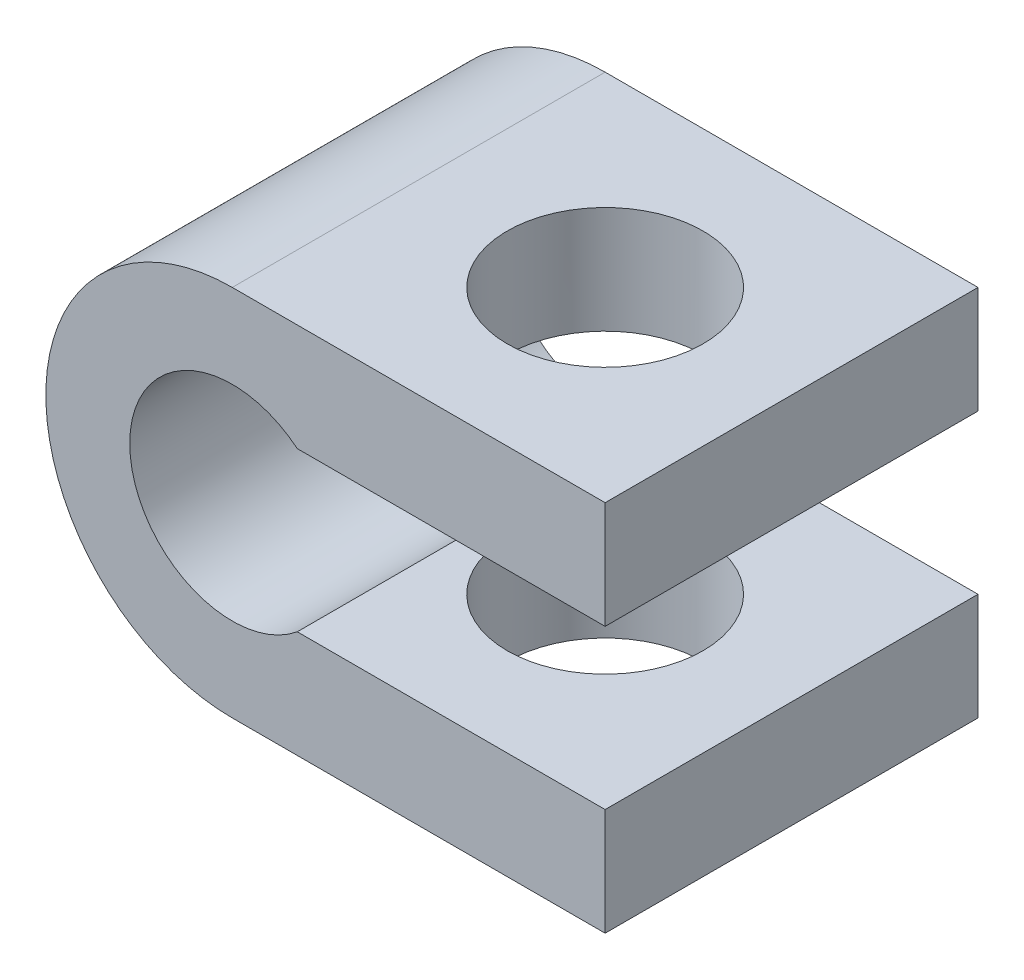
ISO-10303-21;
HEADER;
FILE_DESCRIPTION(('STEP AP214'),'2;1');
FILE_NAME('part.step','',(''),(''),'','','');
FILE_SCHEMA(('AUTOMOTIVE_DESIGN { 1 0 10303 214 1 1 1 1 }'));
ENDSEC;
DATA;
#1=APPLICATION_CONTEXT('core data for automotive mechanical design processes');
#2=APPLICATION_PROTOCOL_DEFINITION('international standard','automotive_design',2000,#1);
#3=PRODUCT_CONTEXT('',#1,'mechanical');
#4=PRODUCT('Part','Part','',(#3));
#5=PRODUCT_RELATED_PRODUCT_CATEGORY('part','',(#4));
#6=PRODUCT_DEFINITION_FORMATION('','',#4);
#7=PRODUCT_DEFINITION_CONTEXT('part definition',#1,'design');
#8=PRODUCT_DEFINITION('design','',#6,#7);
#9=PRODUCT_DEFINITION_SHAPE('','',#8);
#10=(LENGTH_UNIT() NAMED_UNIT(*) SI_UNIT(.MILLI.,.METRE.));
#11=(NAMED_UNIT(*) PLANE_ANGLE_UNIT() SI_UNIT($,.RADIAN.));
#12=(NAMED_UNIT(*) SI_UNIT($,.STERADIAN.) SOLID_ANGLE_UNIT());
#13=UNCERTAINTY_MEASURE_WITH_UNIT(LENGTH_MEASURE(1.E-05),#10,'distance_accuracy_value','');
#14=(GEOMETRIC_REPRESENTATION_CONTEXT(3) GLOBAL_UNCERTAINTY_ASSIGNED_CONTEXT((#13)) GLOBAL_UNIT_ASSIGNED_CONTEXT((#10,
#11,#12)) REPRESENTATION_CONTEXT('',''));
#15=CARTESIAN_POINT('',(0.,0.,0.));
#16=DIRECTION('',(0.,0.,1.));
#17=DIRECTION('',(1.,0.,0.));
#18=AXIS2_PLACEMENT_3D('',#15,#16,#17);
#19=CARTESIAN_POINT('',(0.,0.,12.));
#20=DIRECTION('',(0.,0.,-1.));
#21=DIRECTION('',(-1.,0.,0.));
#22=AXIS2_PLACEMENT_3D('',#19,#20,#21);
#23=CYLINDRICAL_SURFACE('',#22,3.3);
#24=CARTESIAN_POINT('',(0.,0.,0.));
#25=DIRECTION('',(0.,0.,-1.));
#26=DIRECTION('',(1.,0.,0.));
#27=AXIS2_PLACEMENT_3D('',#24,#25,#26);
#28=CIRCLE('',#27,3.3);
#29=CARTESIAN_POINT('',(2.09133180710731,-2.55271057360235,0.));
#30=VERTEX_POINT('',#29);
#31=CARTESIAN_POINT('',(2.09133180710731,2.55271057360235,0.));
#32=VERTEX_POINT('',#31);
#33=EDGE_CURVE('E127',#30,#32,#28,.T.);
#34=ORIENTED_EDGE('',*,*,#33,.T.);
#35=DIRECTION('',(0.,0.,-1.));
#36=VECTOR('',#35,1.);
#37=CARTESIAN_POINT('',(2.09133180710731,2.55271057360235,12.));
#38=LINE('',#37,#36);
#39=CARTESIAN_POINT('',(2.09133180710731,2.55271057360235,12.));
#40=VERTEX_POINT('',#39);
#41=EDGE_CURVE('E11',#40,#32,#38,.T.);
#42=ORIENTED_EDGE('',*,*,#41,.F.);
#43=CARTESIAN_POINT('',(0.,0.,12.));
#44=DIRECTION('',(0.,0.,-1.));
#45=DIRECTION('',(1.,0.,0.));
#46=AXIS2_PLACEMENT_3D('',#43,#44,#45);
#47=CIRCLE('',#46,3.3);
#48=CARTESIAN_POINT('',(2.09133180710731,-2.55271057360235,12.));
#49=VERTEX_POINT('',#48);
#50=EDGE_CURVE('E142',#49,#40,#47,.T.);
#51=ORIENTED_EDGE('',*,*,#50,.F.);
#52=DIRECTION('',(0.,0.,-1.));
#53=VECTOR('',#52,1.);
#54=CARTESIAN_POINT('',(2.09133180710731,-2.55271057360235,12.));
#55=LINE('',#54,#53);
#56=EDGE_CURVE('E123',#49,#30,#55,.T.);
#57=ORIENTED_EDGE('',*,*,#56,.T.);
#58=EDGE_LOOP('',(#34,#42,#51,#57));
#59=FACE_BOUND('',#58,.T.);
#60=ADVANCED_FACE('F30',(#59),#23,.F.);
#61=CARTESIAN_POINT('',(12.,2.55271057360236,12.));
#62=DIRECTION('',(0.,1.,0.));
#63=DIRECTION('',(-1.,0.,0.));
#64=AXIS2_PLACEMENT_3D('',#61,#62,#63);
#65=PLANE('',#64);
#66=CARTESIAN_POINT('',(6.,2.55271057360235,6.));
#67=DIRECTION('',(0.,1.,0.));
#68=DIRECTION('',(-1.,0.,0.));
#69=AXIS2_PLACEMENT_3D('',#66,#67,#68);
#70=CIRCLE('',#69,3.15);
#71=CARTESIAN_POINT('',(2.85,2.55271057360235,6.));
#72=VERTEX_POINT('',#71);
#73=EDGE_CURVE('E131',#72,#72,#70,.T.);
#74=ORIENTED_EDGE('',*,*,#73,.T.);
#75=EDGE_LOOP('',(#74));
#76=FACE_BOUND('',#75,.T.);
#77=DIRECTION('',(1.,0.,0.));
#78=VECTOR('',#77,1.);
#79=CARTESIAN_POINT('',(12.,2.55271057360236,0.));
#80=LINE('',#79,#78);
#81=CARTESIAN_POINT('',(12.,2.55271057360236,0.));
#82=VERTEX_POINT('',#81);
#83=EDGE_CURVE('E130',#32,#82,#80,.T.);
#84=ORIENTED_EDGE('',*,*,#83,.T.);
#85=DIRECTION('',(0.,0.,-1.));
#86=VECTOR('',#85,1.);
#87=CARTESIAN_POINT('',(12.,2.55271057360236,12.));
#88=LINE('',#87,#86);
#89=CARTESIAN_POINT('',(12.,2.55271057360236,12.));
#90=VERTEX_POINT('',#89);
#91=EDGE_CURVE('E39',#90,#82,#88,.T.);
#92=ORIENTED_EDGE('',*,*,#91,.F.);
#93=DIRECTION('',(1.,0.,0.));
#94=VECTOR('',#93,1.);
#95=CARTESIAN_POINT('',(12.,2.55271057360236,12.));
#96=LINE('',#95,#94);
#97=EDGE_CURVE('E90',#40,#90,#96,.T.);
#98=ORIENTED_EDGE('',*,*,#97,.F.);
#99=ORIENTED_EDGE('',*,*,#41,.T.);
#100=EDGE_LOOP('',(#84,#92,#98,#99));
#101=FACE_BOUND('',#100,.T.);
#102=ADVANCED_FACE('F195',(#76,#101),#65,.F.);
#103=CARTESIAN_POINT('',(12.,6.,12.));
#104=DIRECTION('',(-1.,0.,0.));
#105=DIRECTION('',(0.,0.,1.));
#106=AXIS2_PLACEMENT_3D('',#103,#104,#105);
#107=PLANE('',#106);
#108=DIRECTION('',(0.,1.,0.));
#109=VECTOR('',#108,1.);
#110=CARTESIAN_POINT('',(12.,6.,0.));
#111=LINE('',#110,#109);
#112=CARTESIAN_POINT('',(12.,6.,0.));
#113=VERTEX_POINT('',#112);
#114=EDGE_CURVE('E133',#82,#113,#111,.T.);
#115=ORIENTED_EDGE('',*,*,#114,.T.);
#116=DIRECTION('',(0.,0.,-1.));
#117=VECTOR('',#116,1.);
#118=CARTESIAN_POINT('',(12.,6.,12.));
#119=LINE('',#118,#117);
#120=CARTESIAN_POINT('',(12.,6.,12.));
#121=VERTEX_POINT('',#120);
#122=EDGE_CURVE('E149',#121,#113,#119,.T.);
#123=ORIENTED_EDGE('',*,*,#122,.F.);
#124=DIRECTION('',(0.,1.,0.));
#125=VECTOR('',#124,1.);
#126=CARTESIAN_POINT('',(12.,6.,12.));
#127=LINE('',#126,#125);
#128=EDGE_CURVE('E158',#90,#121,#127,.T.);
#129=ORIENTED_EDGE('',*,*,#128,.F.);
#130=ORIENTED_EDGE('',*,*,#91,.T.);
#131=EDGE_LOOP('',(#115,#123,#129,#130));
#132=FACE_BOUND('',#131,.T.);
#133=ADVANCED_FACE('F156',(#132),#107,.F.);
#134=CARTESIAN_POINT('',(0.,6.,12.));
#135=DIRECTION('',(0.,-1.,0.));
#136=DIRECTION('',(0.,0.,-1.));
#137=AXIS2_PLACEMENT_3D('',#134,#135,#136);
#138=PLANE('',#137);
#139=CARTESIAN_POINT('',(6.,6.,6.));
#140=DIRECTION('',(0.,1.,0.));
#141=DIRECTION('',(0.,0.,1.));
#142=AXIS2_PLACEMENT_3D('',#139,#140,#141);
#143=CIRCLE('',#142,3.15);
#144=CARTESIAN_POINT('',(6.,6.,9.15));
#145=VERTEX_POINT('',#144);
#146=EDGE_CURVE('E181',#145,#145,#143,.T.);
#147=ORIENTED_EDGE('',*,*,#146,.F.);
#148=EDGE_LOOP('',(#147));
#149=FACE_BOUND('',#148,.T.);
#150=DIRECTION('',(-1.,0.,0.));
#151=VECTOR('',#150,1.);
#152=CARTESIAN_POINT('',(0.,6.,0.));
#153=LINE('',#152,#151);
#154=CARTESIAN_POINT('',(0.,6.,0.));
#155=VERTEX_POINT('',#154);
#156=EDGE_CURVE('E135',#113,#155,#153,.T.);
#157=ORIENTED_EDGE('',*,*,#156,.T.);
#158=DIRECTION('',(0.,0.,-1.));
#159=VECTOR('',#158,1.);
#160=CARTESIAN_POINT('',(0.,6.,12.));
#161=LINE('',#160,#159);
#162=CARTESIAN_POINT('',(0.,6.,12.));
#163=VERTEX_POINT('',#162);
#164=EDGE_CURVE('E146',#163,#155,#161,.T.);
#165=ORIENTED_EDGE('',*,*,#164,.F.);
#166=DIRECTION('',(-1.,0.,0.));
#167=VECTOR('',#166,1.);
#168=CARTESIAN_POINT('',(0.,6.,12.));
#169=LINE('',#168,#167);
#170=EDGE_CURVE('E170',#121,#163,#169,.T.);
#171=ORIENTED_EDGE('',*,*,#170,.F.);
#172=ORIENTED_EDGE('',*,*,#122,.T.);
#173=EDGE_LOOP('',(#157,#165,#171,#172));
#174=FACE_BOUND('',#173,.T.);
#175=ADVANCED_FACE('F166',(#149,#174),#138,.F.);
#176=CARTESIAN_POINT('',(0.,0.,12.));
#177=DIRECTION('',(0.,0.,-1.));
#178=DIRECTION('',(-1.,0.,0.));
#179=AXIS2_PLACEMENT_3D('',#176,#177,#178);
#180=CYLINDRICAL_SURFACE('',#179,6.);
#181=CARTESIAN_POINT('',(0.,0.,0.));
#182=DIRECTION('',(0.,0.,1.));
#183=DIRECTION('',(1.,0.,0.));
#184=AXIS2_PLACEMENT_3D('',#181,#182,#183);
#185=CIRCLE('',#184,6.);
#186=CARTESIAN_POINT('',(0.,-6.,0.));
#187=VERTEX_POINT('',#186);
#188=EDGE_CURVE('E137',#155,#187,#185,.T.);
#189=ORIENTED_EDGE('',*,*,#188,.T.);
#190=DIRECTION('',(0.,0.,-1.));
#191=VECTOR('',#190,1.);
#192=CARTESIAN_POINT('',(0.,-6.,12.));
#193=LINE('',#192,#191);
#194=CARTESIAN_POINT('',(0.,-6.,12.));
#195=VERTEX_POINT('',#194);
#196=EDGE_CURVE('E118',#195,#187,#193,.T.);
#197=ORIENTED_EDGE('',*,*,#196,.F.);
#198=CARTESIAN_POINT('',(0.,0.,12.));
#199=DIRECTION('',(0.,0.,1.));
#200=DIRECTION('',(1.,0.,0.));
#201=AXIS2_PLACEMENT_3D('',#198,#199,#200);
#202=CIRCLE('',#201,6.);
#203=EDGE_CURVE('E109',#163,#195,#202,.T.);
#204=ORIENTED_EDGE('',*,*,#203,.F.);
#205=ORIENTED_EDGE('',*,*,#164,.T.);
#206=EDGE_LOOP('',(#189,#197,#204,#205));
#207=FACE_BOUND('',#206,.T.);
#208=ADVANCED_FACE('F169',(#207),#180,.T.);
#209=CARTESIAN_POINT('',(0.,-6.,12.));
#210=DIRECTION('',(0.,1.,0.));
#211=DIRECTION('',(0.,0.,1.));
#212=AXIS2_PLACEMENT_3D('',#209,#210,#211);
#213=PLANE('',#212);
#214=CARTESIAN_POINT('',(6.,-6.,6.));
#215=DIRECTION('',(0.,1.,0.));
#216=DIRECTION('',(0.,0.,1.));
#217=AXIS2_PLACEMENT_3D('',#214,#215,#216);
#218=CIRCLE('',#217,3.15);
#219=CARTESIAN_POINT('',(6.,-6.,9.15));
#220=VERTEX_POINT('',#219);
#221=EDGE_CURVE('E178',#220,#220,#218,.T.);
#222=ORIENTED_EDGE('',*,*,#221,.T.);
#223=EDGE_LOOP('',(#222));
#224=FACE_BOUND('',#223,.T.);
#225=DIRECTION('',(1.,0.,0.));
#226=VECTOR('',#225,1.);
#227=CARTESIAN_POINT('',(0.,-6.,0.));
#228=LINE('',#227,#226);
#229=CARTESIAN_POINT('',(12.,-6.,0.));
#230=VERTEX_POINT('',#229);
#231=EDGE_CURVE('E117',#187,#230,#228,.T.);
#232=ORIENTED_EDGE('',*,*,#231,.T.);
#233=DIRECTION('',(0.,0.,-1.));
#234=VECTOR('',#233,1.);
#235=CARTESIAN_POINT('',(12.,-6.,12.));
#236=LINE('',#235,#234);
#237=CARTESIAN_POINT('',(12.,-6.,12.));
#238=VERTEX_POINT('',#237);
#239=EDGE_CURVE('E114',#238,#230,#236,.T.);
#240=ORIENTED_EDGE('',*,*,#239,.F.);
#241=DIRECTION('',(1.,0.,0.));
#242=VECTOR('',#241,1.);
#243=CARTESIAN_POINT('',(0.,-6.,12.));
#244=LINE('',#243,#242);
#245=EDGE_CURVE('E103',#195,#238,#244,.T.);
#246=ORIENTED_EDGE('',*,*,#245,.F.);
#247=ORIENTED_EDGE('',*,*,#196,.T.);
#248=EDGE_LOOP('',(#232,#240,#246,#247));
#249=FACE_BOUND('',#248,.T.);
#250=ADVANCED_FACE('F115',(#224,#249),#213,.F.);
#251=CARTESIAN_POINT('',(12.,-6.,12.));
#252=DIRECTION('',(-1.,0.,0.));
#253=DIRECTION('',(0.,0.,1.));
#254=AXIS2_PLACEMENT_3D('',#251,#252,#253);
#255=PLANE('',#254);
#256=DIRECTION('',(0.,1.,0.));
#257=VECTOR('',#256,1.);
#258=CARTESIAN_POINT('',(12.,-6.,0.));
#259=LINE('',#258,#257);
#260=CARTESIAN_POINT('',(12.,-2.55271057360236,0.));
#261=VERTEX_POINT('',#260);
#262=EDGE_CURVE('E76',#230,#261,#259,.T.);
#263=ORIENTED_EDGE('',*,*,#262,.T.);
#264=DIRECTION('',(0.,0.,-1.));
#265=VECTOR('',#264,1.);
#266=CARTESIAN_POINT('',(12.,-2.55271057360236,12.));
#267=LINE('',#266,#265);
#268=CARTESIAN_POINT('',(12.,-2.55271057360236,12.));
#269=VERTEX_POINT('',#268);
#270=EDGE_CURVE('E119',#269,#261,#267,.T.);
#271=ORIENTED_EDGE('',*,*,#270,.F.);
#272=DIRECTION('',(0.,1.,0.));
#273=VECTOR('',#272,1.);
#274=CARTESIAN_POINT('',(12.,-6.,12.));
#275=LINE('',#274,#273);
#276=EDGE_CURVE('E107',#238,#269,#275,.T.);
#277=ORIENTED_EDGE('',*,*,#276,.F.);
#278=ORIENTED_EDGE('',*,*,#239,.T.);
#279=EDGE_LOOP('',(#263,#271,#277,#278));
#280=FACE_BOUND('',#279,.T.);
#281=ADVANCED_FACE('F121',(#280),#255,.F.);
#282=CARTESIAN_POINT('',(12.,-2.55271057360236,12.));
#283=DIRECTION('',(0.,-1.,0.));
#284=DIRECTION('',(1.,0.,0.));
#285=AXIS2_PLACEMENT_3D('',#282,#283,#284);
#286=PLANE('',#285);
#287=CARTESIAN_POINT('',(6.,-2.55271057360236,6.));
#288=DIRECTION('',(0.,-1.,0.));
#289=DIRECTION('',(1.,0.,0.));
#290=AXIS2_PLACEMENT_3D('',#287,#288,#289);
#291=CIRCLE('',#290,3.15);
#292=CARTESIAN_POINT('',(9.15,-2.55271057360236,6.));
#293=VERTEX_POINT('',#292);
#294=EDGE_CURVE('E33',#293,#293,#291,.T.);
#295=ORIENTED_EDGE('',*,*,#294,.T.);
#296=EDGE_LOOP('',(#295));
#297=FACE_BOUND('',#296,.T.);
#298=DIRECTION('',(-1.,0.,0.));
#299=VECTOR('',#298,1.);
#300=CARTESIAN_POINT('',(12.,-2.55271057360236,0.));
#301=LINE('',#300,#299);
#302=EDGE_CURVE('E82',#261,#30,#301,.T.);
#303=ORIENTED_EDGE('',*,*,#302,.T.);
#304=ORIENTED_EDGE('',*,*,#56,.F.);
#305=DIRECTION('',(-1.,0.,0.));
#306=VECTOR('',#305,1.);
#307=CARTESIAN_POINT('',(12.,-2.55271057360236,12.));
#308=LINE('',#307,#306);
#309=EDGE_CURVE('E47',#269,#49,#308,.T.);
#310=ORIENTED_EDGE('',*,*,#309,.F.);
#311=ORIENTED_EDGE('',*,*,#270,.T.);
#312=EDGE_LOOP('',(#303,#304,#310,#311));
#313=FACE_BOUND('',#312,.T.);
#314=ADVANCED_FACE('F205',(#297,#313),#286,.F.);
#315=CARTESIAN_POINT('',(0.,0.,12.));
#316=DIRECTION('',(0.,0.,1.));
#317=DIRECTION('',(1.,0.,0.));
#318=AXIS2_PLACEMENT_3D('',#315,#316,#317);
#319=PLANE('',#318);
#320=ORIENTED_EDGE('',*,*,#50,.T.);
#321=ORIENTED_EDGE('',*,*,#97,.T.);
#322=ORIENTED_EDGE('',*,*,#128,.T.);
#323=ORIENTED_EDGE('',*,*,#170,.T.);
#324=ORIENTED_EDGE('',*,*,#203,.T.);
#325=ORIENTED_EDGE('',*,*,#245,.T.);
#326=ORIENTED_EDGE('',*,*,#276,.T.);
#327=ORIENTED_EDGE('',*,*,#309,.T.);
#328=EDGE_LOOP('',(#320,#321,#322,#323,#324,#325,#326,#327));
#329=FACE_BOUND('',#328,.T.);
#330=ADVANCED_FACE('F105',(#329),#319,.T.);
#331=CARTESIAN_POINT('',(0.,0.,0.));
#332=DIRECTION('',(0.,0.,1.));
#333=DIRECTION('',(1.,0.,0.));
#334=AXIS2_PLACEMENT_3D('',#331,#332,#333);
#335=PLANE('',#334);
#336=ORIENTED_EDGE('',*,*,#33,.F.);
#337=ORIENTED_EDGE('',*,*,#302,.F.);
#338=ORIENTED_EDGE('',*,*,#262,.F.);
#339=ORIENTED_EDGE('',*,*,#231,.F.);
#340=ORIENTED_EDGE('',*,*,#188,.F.);
#341=ORIENTED_EDGE('',*,*,#156,.F.);
#342=ORIENTED_EDGE('',*,*,#114,.F.);
#343=ORIENTED_EDGE('',*,*,#83,.F.);
#344=EDGE_LOOP('',(#336,#337,#338,#339,#340,#341,#342,#343));
#345=FACE_BOUND('',#344,.T.);
#346=ADVANCED_FACE('F162',(#345),#335,.F.);
#347=CARTESIAN_POINT('',(6.,-6.,6.));
#348=DIRECTION('',(0.,1.,0.));
#349=DIRECTION('',(0.,0.,1.));
#350=AXIS2_PLACEMENT_3D('',#347,#348,#349);
#351=CYLINDRICAL_SURFACE('',#350,3.15);
#352=ORIENTED_EDGE('',*,*,#221,.F.);
#353=EDGE_LOOP('',(#352));
#354=FACE_BOUND('',#353,.T.);
#355=ORIENTED_EDGE('',*,*,#294,.F.);
#356=EDGE_LOOP('',(#355));
#357=FACE_BOUND('',#356,.T.);
#358=ADVANCED_FACE('F224',(#354,#357),#351,.F.);
#359=ORIENTED_EDGE('',*,*,#146,.T.);
#360=EDGE_LOOP('',(#359));
#361=FACE_BOUND('',#360,.T.);
#362=ORIENTED_EDGE('',*,*,#73,.F.);
#363=EDGE_LOOP('',(#362));
#364=FACE_BOUND('',#363,.T.);
#365=ADVANCED_FACE('F185',(#361,#364),#351,.F.);
#366=CLOSED_SHELL('',(#60,#102,#133,#175,#208,#250,#281,#314,#330,#346,#358,#365));
#367=MANIFOLD_SOLID_BREP('B2',#366);
#368=ADVANCED_BREP_SHAPE_REPRESENTATION('',(#18,#367),#14);
#369=SHAPE_DEFINITION_REPRESENTATION(#9,#368);
ENDSEC;
END-ISO-10303-21;
